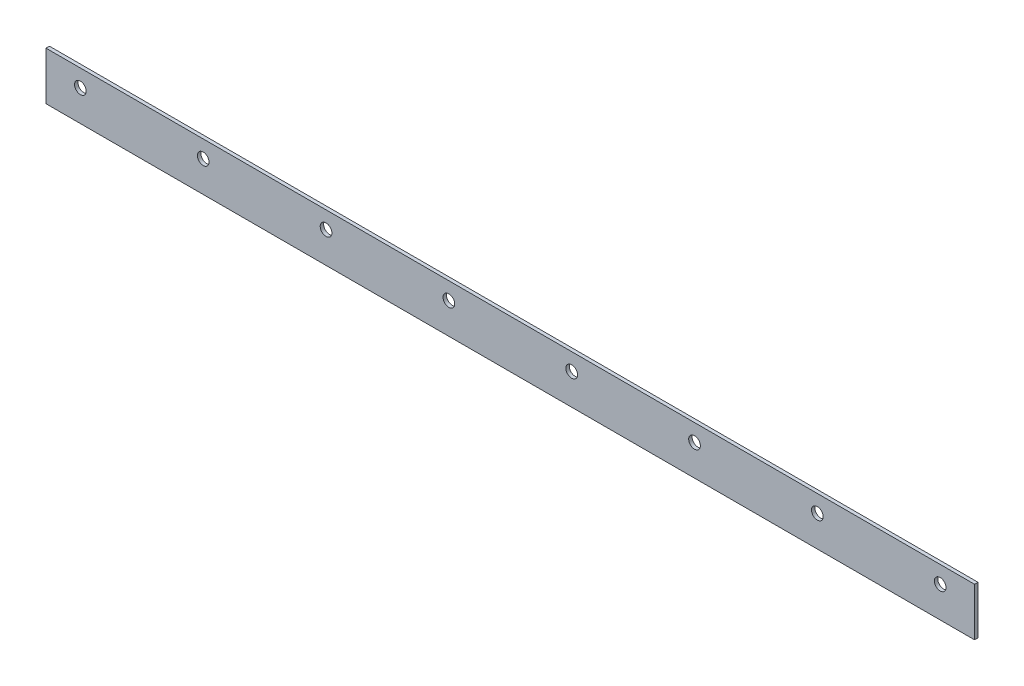
ISO-10303-21;
HEADER;
FILE_DESCRIPTION(('STEP AP214'),'2;1');
FILE_NAME('part.step','',(''),(''),'','','');
FILE_SCHEMA(('AUTOMOTIVE_DESIGN { 1 0 10303 214 1 1 1 1 }'));
ENDSEC;
DATA;
#1=APPLICATION_CONTEXT('core data for automotive mechanical design processes');
#2=APPLICATION_PROTOCOL_DEFINITION('international standard','automotive_design',2000,#1);
#3=PRODUCT_CONTEXT('',#1,'mechanical');
#4=PRODUCT('Part','Part','',(#3));
#5=PRODUCT_RELATED_PRODUCT_CATEGORY('part','',(#4));
#6=PRODUCT_DEFINITION_FORMATION('','',#4);
#7=PRODUCT_DEFINITION_CONTEXT('part definition',#1,'design');
#8=PRODUCT_DEFINITION('design','',#6,#7);
#9=PRODUCT_DEFINITION_SHAPE('','',#8);
#10=(LENGTH_UNIT() NAMED_UNIT(*) SI_UNIT(.MILLI.,.METRE.));
#11=(NAMED_UNIT(*) PLANE_ANGLE_UNIT() SI_UNIT($,.RADIAN.));
#12=(NAMED_UNIT(*) SI_UNIT($,.STERADIAN.) SOLID_ANGLE_UNIT());
#13=UNCERTAINTY_MEASURE_WITH_UNIT(LENGTH_MEASURE(1.E-05),#10,'distance_accuracy_value','');
#14=(GEOMETRIC_REPRESENTATION_CONTEXT(3) GLOBAL_UNCERTAINTY_ASSIGNED_CONTEXT((#13)) GLOBAL_UNIT_ASSIGNED_CONTEXT((#10,
#11,#12)) REPRESENTATION_CONTEXT('',''));
#15=CARTESIAN_POINT('',(0.,0.,0.));
#16=DIRECTION('',(0.,0.,1.));
#17=DIRECTION('',(1.,0.,0.));
#18=AXIS2_PLACEMENT_3D('',#15,#16,#17);
#19=CARTESIAN_POINT('',(-125.,1.99999999999995,1.));
#20=DIRECTION('',(0.,0.,1.));
#21=DIRECTION('',(1.,0.,0.));
#22=AXIS2_PLACEMENT_3D('',#19,#20,#21);
#23=CYLINDRICAL_SURFACE('',#22,1.69999999999999);
#24=CARTESIAN_POINT('',(-125.,1.99999999999995,0.));
#25=DIRECTION('',(0.,0.,1.));
#26=DIRECTION('',(1.,0.,0.));
#27=AXIS2_PLACEMENT_3D('',#24,#25,#26);
#28=CIRCLE('',#27,1.69999999999999);
#29=CARTESIAN_POINT('',(-123.3,1.99999999999995,0.));
#30=VERTEX_POINT('',#29);
#31=EDGE_CURVE('E43',#30,#30,#28,.T.);
#32=ORIENTED_EDGE('',*,*,#31,.F.);
#33=EDGE_LOOP('',(#32));
#34=FACE_BOUND('',#33,.T.);
#35=CARTESIAN_POINT('',(-125.,1.99999999999995,1.));
#36=DIRECTION('',(0.,0.,1.));
#37=DIRECTION('',(1.,0.,0.));
#38=AXIS2_PLACEMENT_3D('',#35,#36,#37);
#39=CIRCLE('',#38,1.69999999999999);
#40=CARTESIAN_POINT('',(-123.3,1.99999999999995,1.));
#41=VERTEX_POINT('',#40);
#42=EDGE_CURVE('E11',#41,#41,#39,.T.);
#43=ORIENTED_EDGE('',*,*,#42,.T.);
#44=EDGE_LOOP('',(#43));
#45=FACE_BOUND('',#44,.T.);
#46=ADVANCED_FACE('F35',(#34,#45),#23,.F.);
#47=CARTESIAN_POINT('',(-89.2857142857143,1.99999999999996,1.));
#48=DIRECTION('',(0.,0.,1.));
#49=DIRECTION('',(1.,0.,0.));
#50=AXIS2_PLACEMENT_3D('',#47,#48,#49);
#51=CYLINDRICAL_SURFACE('',#50,1.69999999999999);
#52=CARTESIAN_POINT('',(-89.2857142857143,1.99999999999996,0.));
#53=DIRECTION('',(0.,0.,1.));
#54=DIRECTION('',(1.,0.,0.));
#55=AXIS2_PLACEMENT_3D('',#52,#53,#54);
#56=CIRCLE('',#55,1.69999999999999);
#57=CARTESIAN_POINT('',(-87.5857142857143,1.99999999999996,0.));
#58=VERTEX_POINT('',#57);
#59=EDGE_CURVE('E137',#58,#58,#56,.T.);
#60=ORIENTED_EDGE('',*,*,#59,.F.);
#61=EDGE_LOOP('',(#60));
#62=FACE_BOUND('',#61,.T.);
#63=CARTESIAN_POINT('',(-89.2857142857143,1.99999999999996,1.));
#64=DIRECTION('',(0.,0.,1.));
#65=DIRECTION('',(1.,0.,0.));
#66=AXIS2_PLACEMENT_3D('',#63,#64,#65);
#67=CIRCLE('',#66,1.69999999999999);
#68=CARTESIAN_POINT('',(-87.5857142857143,1.99999999999996,1.));
#69=VERTEX_POINT('',#68);
#70=EDGE_CURVE('E140',#69,#69,#67,.T.);
#71=ORIENTED_EDGE('',*,*,#70,.T.);
#72=EDGE_LOOP('',(#71));
#73=FACE_BOUND('',#72,.T.);
#74=ADVANCED_FACE('F149',(#62,#73),#51,.F.);
#75=CARTESIAN_POINT('',(-53.5714285714286,1.99999999999996,1.));
#76=DIRECTION('',(0.,0.,1.));
#77=DIRECTION('',(1.,0.,0.));
#78=AXIS2_PLACEMENT_3D('',#75,#76,#77);
#79=CYLINDRICAL_SURFACE('',#78,1.69999999999999);
#80=CARTESIAN_POINT('',(-53.5714285714286,1.99999999999996,0.));
#81=DIRECTION('',(0.,0.,1.));
#82=DIRECTION('',(1.,0.,0.));
#83=AXIS2_PLACEMENT_3D('',#80,#81,#82);
#84=CIRCLE('',#83,1.69999999999999);
#85=CARTESIAN_POINT('',(-51.8714285714286,1.99999999999996,0.));
#86=VERTEX_POINT('',#85);
#87=EDGE_CURVE('E131',#86,#86,#84,.T.);
#88=ORIENTED_EDGE('',*,*,#87,.F.);
#89=EDGE_LOOP('',(#88));
#90=FACE_BOUND('',#89,.T.);
#91=CARTESIAN_POINT('',(-53.5714285714286,1.99999999999996,1.));
#92=DIRECTION('',(0.,0.,1.));
#93=DIRECTION('',(1.,0.,0.));
#94=AXIS2_PLACEMENT_3D('',#91,#92,#93);
#95=CIRCLE('',#94,1.69999999999999);
#96=CARTESIAN_POINT('',(-51.8714285714286,1.99999999999996,1.));
#97=VERTEX_POINT('',#96);
#98=EDGE_CURVE('E134',#97,#97,#95,.T.);
#99=ORIENTED_EDGE('',*,*,#98,.T.);
#100=EDGE_LOOP('',(#99));
#101=FACE_BOUND('',#100,.T.);
#102=ADVANCED_FACE('F188',(#90,#101),#79,.F.);
#103=CARTESIAN_POINT('',(-17.8571428571429,1.99999999999997,1.));
#104=DIRECTION('',(0.,0.,1.));
#105=DIRECTION('',(1.,0.,0.));
#106=AXIS2_PLACEMENT_3D('',#103,#104,#105);
#107=CYLINDRICAL_SURFACE('',#106,1.69999999999999);
#108=CARTESIAN_POINT('',(-17.8571428571429,1.99999999999997,0.));
#109=DIRECTION('',(0.,0.,1.));
#110=DIRECTION('',(1.,0.,0.));
#111=AXIS2_PLACEMENT_3D('',#108,#109,#110);
#112=CIRCLE('',#111,1.69999999999999);
#113=CARTESIAN_POINT('',(-16.1571428571429,1.99999999999997,0.));
#114=VERTEX_POINT('',#113);
#115=EDGE_CURVE('E125',#114,#114,#112,.T.);
#116=ORIENTED_EDGE('',*,*,#115,.F.);
#117=EDGE_LOOP('',(#116));
#118=FACE_BOUND('',#117,.T.);
#119=CARTESIAN_POINT('',(-17.8571428571429,1.99999999999997,1.));
#120=DIRECTION('',(0.,0.,1.));
#121=DIRECTION('',(1.,0.,0.));
#122=AXIS2_PLACEMENT_3D('',#119,#120,#121);
#123=CIRCLE('',#122,1.69999999999999);
#124=CARTESIAN_POINT('',(-16.1571428571429,1.99999999999997,1.));
#125=VERTEX_POINT('',#124);
#126=EDGE_CURVE('E128',#125,#125,#123,.T.);
#127=ORIENTED_EDGE('',*,*,#126,.T.);
#128=EDGE_LOOP('',(#127));
#129=FACE_BOUND('',#128,.T.);
#130=ADVANCED_FACE('F184',(#118,#129),#107,.F.);
#131=CARTESIAN_POINT('',(17.8571428571429,1.99999999999997,1.));
#132=DIRECTION('',(0.,0.,1.));
#133=DIRECTION('',(1.,0.,0.));
#134=AXIS2_PLACEMENT_3D('',#131,#132,#133);
#135=CYLINDRICAL_SURFACE('',#134,1.69999999999999);
#136=CARTESIAN_POINT('',(17.8571428571429,1.99999999999997,0.));
#137=DIRECTION('',(0.,0.,1.));
#138=DIRECTION('',(1.,0.,0.));
#139=AXIS2_PLACEMENT_3D('',#136,#137,#138);
#140=CIRCLE('',#139,1.69999999999999);
#141=CARTESIAN_POINT('',(19.5571428571428,1.99999999999997,0.));
#142=VERTEX_POINT('',#141);
#143=EDGE_CURVE('E119',#142,#142,#140,.T.);
#144=ORIENTED_EDGE('',*,*,#143,.F.);
#145=EDGE_LOOP('',(#144));
#146=FACE_BOUND('',#145,.T.);
#147=CARTESIAN_POINT('',(17.8571428571429,1.99999999999997,1.));
#148=DIRECTION('',(0.,0.,1.));
#149=DIRECTION('',(1.,0.,0.));
#150=AXIS2_PLACEMENT_3D('',#147,#148,#149);
#151=CIRCLE('',#150,1.69999999999999);
#152=CARTESIAN_POINT('',(19.5571428571428,1.99999999999997,1.));
#153=VERTEX_POINT('',#152);
#154=EDGE_CURVE('E122',#153,#153,#151,.T.);
#155=ORIENTED_EDGE('',*,*,#154,.T.);
#156=EDGE_LOOP('',(#155));
#157=FACE_BOUND('',#156,.T.);
#158=ADVANCED_FACE('F180',(#146,#157),#135,.F.);
#159=CARTESIAN_POINT('',(53.5714285714286,1.99999999999997,1.));
#160=DIRECTION('',(0.,0.,1.));
#161=DIRECTION('',(1.,0.,0.));
#162=AXIS2_PLACEMENT_3D('',#159,#160,#161);
#163=CYLINDRICAL_SURFACE('',#162,1.69999999999999);
#164=CARTESIAN_POINT('',(53.5714285714286,1.99999999999997,0.));
#165=DIRECTION('',(0.,0.,1.));
#166=DIRECTION('',(1.,0.,0.));
#167=AXIS2_PLACEMENT_3D('',#164,#165,#166);
#168=CIRCLE('',#167,1.69999999999999);
#169=CARTESIAN_POINT('',(55.2714285714286,1.99999999999997,0.));
#170=VERTEX_POINT('',#169);
#171=EDGE_CURVE('E113',#170,#170,#168,.T.);
#172=ORIENTED_EDGE('',*,*,#171,.F.);
#173=EDGE_LOOP('',(#172));
#174=FACE_BOUND('',#173,.T.);
#175=CARTESIAN_POINT('',(53.5714285714286,1.99999999999997,1.));
#176=DIRECTION('',(0.,0.,1.));
#177=DIRECTION('',(1.,0.,0.));
#178=AXIS2_PLACEMENT_3D('',#175,#176,#177);
#179=CIRCLE('',#178,1.69999999999999);
#180=CARTESIAN_POINT('',(55.2714285714286,1.99999999999997,1.));
#181=VERTEX_POINT('',#180);
#182=EDGE_CURVE('E116',#181,#181,#179,.T.);
#183=ORIENTED_EDGE('',*,*,#182,.T.);
#184=EDGE_LOOP('',(#183));
#185=FACE_BOUND('',#184,.T.);
#186=ADVANCED_FACE('F176',(#174,#185),#163,.F.);
#187=CARTESIAN_POINT('',(-135.,-7.00000000000002,1.));
#188=DIRECTION('',(1.,0.,0.));
#189=DIRECTION('',(0.,0.,-1.));
#190=AXIS2_PLACEMENT_3D('',#187,#188,#189);
#191=PLANE('',#190);
#192=DIRECTION('',(0.,-1.,0.));
#193=VECTOR('',#192,1.);
#194=CARTESIAN_POINT('',(-135.,-7.00000000000002,0.));
#195=LINE('',#194,#193);
#196=CARTESIAN_POINT('',(-135.,6.99999999999998,0.));
#197=VERTEX_POINT('',#196);
#198=CARTESIAN_POINT('',(-135.,-7.00000000000002,0.));
#199=VERTEX_POINT('',#198);
#200=EDGE_CURVE('E103',#197,#199,#195,.T.);
#201=ORIENTED_EDGE('',*,*,#200,.T.);
#202=DIRECTION('',(0.,0.,-1.));
#203=VECTOR('',#202,1.);
#204=CARTESIAN_POINT('',(-135.,-7.00000000000002,1.));
#205=LINE('',#204,#203);
#206=CARTESIAN_POINT('',(-135.,-7.00000000000002,1.));
#207=VERTEX_POINT('',#206);
#208=EDGE_CURVE('E94',#207,#199,#205,.T.);
#209=ORIENTED_EDGE('',*,*,#208,.F.);
#210=DIRECTION('',(0.,-1.,0.));
#211=VECTOR('',#210,1.);
#212=CARTESIAN_POINT('',(-135.,-7.00000000000002,1.));
#213=LINE('',#212,#211);
#214=CARTESIAN_POINT('',(-135.,6.99999999999998,1.));
#215=VERTEX_POINT('',#214);
#216=EDGE_CURVE('E88',#215,#207,#213,.T.);
#217=ORIENTED_EDGE('',*,*,#216,.F.);
#218=DIRECTION('',(0.,0.,-1.));
#219=VECTOR('',#218,1.);
#220=CARTESIAN_POINT('',(-135.,6.99999999999998,1.));
#221=LINE('',#220,#219);
#222=EDGE_CURVE('E99',#215,#197,#221,.T.);
#223=ORIENTED_EDGE('',*,*,#222,.T.);
#224=EDGE_LOOP('',(#201,#209,#217,#223));
#225=FACE_BOUND('',#224,.T.);
#226=ADVANCED_FACE('F173',(#225),#191,.F.);
#227=CARTESIAN_POINT('',(135.,-6.99999999999998,1.));
#228=DIRECTION('',(0.,1.,0.));
#229=DIRECTION('',(-1.,0.,0.));
#230=AXIS2_PLACEMENT_3D('',#227,#228,#229);
#231=PLANE('',#230);
#232=DIRECTION('',(1.,0.,0.));
#233=VECTOR('',#232,1.);
#234=CARTESIAN_POINT('',(135.,-6.99999999999998,0.));
#235=LINE('',#234,#233);
#236=CARTESIAN_POINT('',(135.,-6.99999999999998,0.));
#237=VERTEX_POINT('',#236);
#238=EDGE_CURVE('E93',#199,#237,#235,.T.);
#239=ORIENTED_EDGE('',*,*,#238,.T.);
#240=DIRECTION('',(0.,0.,-1.));
#241=VECTOR('',#240,1.);
#242=CARTESIAN_POINT('',(135.,-6.99999999999998,1.));
#243=LINE('',#242,#241);
#244=CARTESIAN_POINT('',(135.,-6.99999999999998,1.));
#245=VERTEX_POINT('',#244);
#246=EDGE_CURVE('E91',#245,#237,#243,.T.);
#247=ORIENTED_EDGE('',*,*,#246,.F.);
#248=DIRECTION('',(1.,0.,0.));
#249=VECTOR('',#248,1.);
#250=CARTESIAN_POINT('',(135.,-6.99999999999998,1.));
#251=LINE('',#250,#249);
#252=EDGE_CURVE('E82',#207,#245,#251,.T.);
#253=ORIENTED_EDGE('',*,*,#252,.F.);
#254=ORIENTED_EDGE('',*,*,#208,.T.);
#255=EDGE_LOOP('',(#239,#247,#253,#254));
#256=FACE_BOUND('',#255,.T.);
#257=ADVANCED_FACE('F92',(#256),#231,.F.);
#258=CARTESIAN_POINT('',(135.,-6.99999999999998,1.));
#259=DIRECTION('',(-1.,0.,0.));
#260=DIRECTION('',(0.,0.,1.));
#261=AXIS2_PLACEMENT_3D('',#258,#259,#260);
#262=PLANE('',#261);
#263=DIRECTION('',(0.,1.,0.));
#264=VECTOR('',#263,1.);
#265=CARTESIAN_POINT('',(135.,-6.99999999999998,0.));
#266=LINE('',#265,#264);
#267=CARTESIAN_POINT('',(135.,7.00000000000002,0.));
#268=VERTEX_POINT('',#267);
#269=EDGE_CURVE('E68',#237,#268,#266,.T.);
#270=ORIENTED_EDGE('',*,*,#269,.T.);
#271=DIRECTION('',(0.,0.,-1.));
#272=VECTOR('',#271,1.);
#273=CARTESIAN_POINT('',(135.,7.00000000000002,1.));
#274=LINE('',#273,#272);
#275=CARTESIAN_POINT('',(135.,7.00000000000002,1.));
#276=VERTEX_POINT('',#275);
#277=EDGE_CURVE('E95',#276,#268,#274,.T.);
#278=ORIENTED_EDGE('',*,*,#277,.F.);
#279=DIRECTION('',(0.,1.,0.));
#280=VECTOR('',#279,1.);
#281=CARTESIAN_POINT('',(135.,-6.99999999999998,1.));
#282=LINE('',#281,#280);
#283=EDGE_CURVE('E86',#245,#276,#282,.T.);
#284=ORIENTED_EDGE('',*,*,#283,.F.);
#285=ORIENTED_EDGE('',*,*,#246,.T.);
#286=EDGE_LOOP('',(#270,#278,#284,#285));
#287=FACE_BOUND('',#286,.T.);
#288=ADVANCED_FACE('F97',(#287),#262,.F.);
#289=CARTESIAN_POINT('',(135.,7.00000000000002,1.));
#290=DIRECTION('',(0.,-1.,0.));
#291=DIRECTION('',(1.,0.,0.));
#292=AXIS2_PLACEMENT_3D('',#289,#290,#291);
#293=PLANE('',#292);
#294=DIRECTION('',(-1.,0.,0.));
#295=VECTOR('',#294,1.);
#296=CARTESIAN_POINT('',(135.,7.00000000000002,0.));
#297=LINE('',#296,#295);
#298=EDGE_CURVE('E74',#268,#197,#297,.T.);
#299=ORIENTED_EDGE('',*,*,#298,.T.);
#300=ORIENTED_EDGE('',*,*,#222,.F.);
#301=DIRECTION('',(-1.,0.,0.));
#302=VECTOR('',#301,1.);
#303=CARTESIAN_POINT('',(135.,7.00000000000002,1.));
#304=LINE('',#303,#302);
#305=EDGE_CURVE('E51',#276,#215,#304,.T.);
#306=ORIENTED_EDGE('',*,*,#305,.F.);
#307=ORIENTED_EDGE('',*,*,#277,.T.);
#308=EDGE_LOOP('',(#299,#300,#306,#307));
#309=FACE_BOUND('',#308,.T.);
#310=ADVANCED_FACE('F153',(#309),#293,.F.);
#311=CARTESIAN_POINT('',(0.,0.,1.));
#312=DIRECTION('',(0.,0.,1.));
#313=DIRECTION('',(1.,0.,0.));
#314=AXIS2_PLACEMENT_3D('',#311,#312,#313);
#315=PLANE('',#314);
#316=CARTESIAN_POINT('',(89.2857142857143,1.99999999999998,1.));
#317=DIRECTION('',(0.,0.,1.));
#318=DIRECTION('',(1.,0.,0.));
#319=AXIS2_PLACEMENT_3D('',#316,#317,#318);
#320=CIRCLE('',#319,1.69999999999999);
#321=CARTESIAN_POINT('',(90.9857142857143,1.99999999999998,1.));
#322=VERTEX_POINT('',#321);
#323=EDGE_CURVE('E285',#322,#322,#320,.T.);
#324=ORIENTED_EDGE('',*,*,#323,.F.);
#325=EDGE_LOOP('',(#324));
#326=FACE_BOUND('',#325,.T.);
#327=CARTESIAN_POINT('',(125.,1.99999999999998,1.));
#328=DIRECTION('',(0.,0.,1.));
#329=DIRECTION('',(1.,0.,0.));
#330=AXIS2_PLACEMENT_3D('',#327,#328,#329);
#331=CIRCLE('',#330,1.69999999999999);
#332=CARTESIAN_POINT('',(126.7,1.99999999999998,1.));
#333=VERTEX_POINT('',#332);
#334=EDGE_CURVE('E286',#333,#333,#331,.T.);
#335=ORIENTED_EDGE('',*,*,#334,.F.);
#336=EDGE_LOOP('',(#335));
#337=FACE_BOUND('',#336,.T.);
#338=ORIENTED_EDGE('',*,*,#216,.T.);
#339=ORIENTED_EDGE('',*,*,#252,.T.);
#340=ORIENTED_EDGE('',*,*,#283,.T.);
#341=ORIENTED_EDGE('',*,*,#305,.T.);
#342=EDGE_LOOP('',(#338,#339,#340,#341));
#343=FACE_BOUND('',#342,.T.);
#344=ORIENTED_EDGE('',*,*,#182,.F.);
#345=EDGE_LOOP('',(#344));
#346=FACE_BOUND('',#345,.T.);
#347=ORIENTED_EDGE('',*,*,#154,.F.);
#348=EDGE_LOOP('',(#347));
#349=FACE_BOUND('',#348,.T.);
#350=ORIENTED_EDGE('',*,*,#126,.F.);
#351=EDGE_LOOP('',(#350));
#352=FACE_BOUND('',#351,.T.);
#353=ORIENTED_EDGE('',*,*,#98,.F.);
#354=EDGE_LOOP('',(#353));
#355=FACE_BOUND('',#354,.T.);
#356=ORIENTED_EDGE('',*,*,#70,.F.);
#357=EDGE_LOOP('',(#356));
#358=FACE_BOUND('',#357,.T.);
#359=ORIENTED_EDGE('',*,*,#42,.F.);
#360=EDGE_LOOP('',(#359));
#361=FACE_BOUND('',#360,.T.);
#362=ADVANCED_FACE('F83',(#326,#337,#343,#346,#349,#352,#355,#358,#361),#315,.T.);
#363=CARTESIAN_POINT('',(0.,0.,0.));
#364=DIRECTION('',(0.,0.,1.));
#365=DIRECTION('',(1.,0.,0.));
#366=AXIS2_PLACEMENT_3D('',#363,#364,#365);
#367=PLANE('',#366);
#368=CARTESIAN_POINT('',(89.2857142857143,1.99999999999998,0.));
#369=DIRECTION('',(0.,0.,1.));
#370=DIRECTION('',(1.,0.,0.));
#371=AXIS2_PLACEMENT_3D('',#368,#369,#370);
#372=CIRCLE('',#371,1.69999999999999);
#373=CARTESIAN_POINT('',(90.9857142857143,1.99999999999998,0.));
#374=VERTEX_POINT('',#373);
#375=EDGE_CURVE('E283',#374,#374,#372,.T.);
#376=ORIENTED_EDGE('',*,*,#375,.T.);
#377=EDGE_LOOP('',(#376));
#378=FACE_BOUND('',#377,.T.);
#379=CARTESIAN_POINT('',(125.,1.99999999999998,0.));
#380=DIRECTION('',(0.,0.,1.));
#381=DIRECTION('',(1.,0.,0.));
#382=AXIS2_PLACEMENT_3D('',#379,#380,#381);
#383=CIRCLE('',#382,1.69999999999999);
#384=CARTESIAN_POINT('',(126.7,1.99999999999998,0.));
#385=VERTEX_POINT('',#384);
#386=EDGE_CURVE('E106',#385,#385,#383,.T.);
#387=ORIENTED_EDGE('',*,*,#386,.T.);
#388=EDGE_LOOP('',(#387));
#389=FACE_BOUND('',#388,.T.);
#390=ORIENTED_EDGE('',*,*,#200,.F.);
#391=ORIENTED_EDGE('',*,*,#298,.F.);
#392=ORIENTED_EDGE('',*,*,#269,.F.);
#393=ORIENTED_EDGE('',*,*,#238,.F.);
#394=EDGE_LOOP('',(#390,#391,#392,#393));
#395=FACE_BOUND('',#394,.T.);
#396=ORIENTED_EDGE('',*,*,#171,.T.);
#397=EDGE_LOOP('',(#396));
#398=FACE_BOUND('',#397,.T.);
#399=ORIENTED_EDGE('',*,*,#143,.T.);
#400=EDGE_LOOP('',(#399));
#401=FACE_BOUND('',#400,.T.);
#402=ORIENTED_EDGE('',*,*,#115,.T.);
#403=EDGE_LOOP('',(#402));
#404=FACE_BOUND('',#403,.T.);
#405=ORIENTED_EDGE('',*,*,#87,.T.);
#406=EDGE_LOOP('',(#405));
#407=FACE_BOUND('',#406,.T.);
#408=ORIENTED_EDGE('',*,*,#59,.T.);
#409=EDGE_LOOP('',(#408));
#410=FACE_BOUND('',#409,.T.);
#411=ORIENTED_EDGE('',*,*,#31,.T.);
#412=EDGE_LOOP('',(#411));
#413=FACE_BOUND('',#412,.T.);
#414=ADVANCED_FACE('F145',(#378,#389,#395,#398,#401,#404,#407,#410,#413),#367,.F.);
#415=CARTESIAN_POINT('',(125.,1.99999999999998,1.));
#416=DIRECTION('',(0.,0.,1.));
#417=DIRECTION('',(1.,0.,0.));
#418=AXIS2_PLACEMENT_3D('',#415,#416,#417);
#419=CYLINDRICAL_SURFACE('',#418,1.69999999999999);
#420=ORIENTED_EDGE('',*,*,#386,.F.);
#421=EDGE_LOOP('',(#420));
#422=FACE_BOUND('',#421,.T.);
#423=ORIENTED_EDGE('',*,*,#334,.T.);
#424=EDGE_LOOP('',(#423));
#425=FACE_BOUND('',#424,.T.);
#426=ADVANCED_FACE('F160',(#422,#425),#419,.F.);
#427=CARTESIAN_POINT('',(89.2857142857143,1.99999999999998,1.));
#428=DIRECTION('',(0.,0.,1.));
#429=DIRECTION('',(1.,0.,0.));
#430=AXIS2_PLACEMENT_3D('',#427,#428,#429);
#431=CYLINDRICAL_SURFACE('',#430,1.69999999999999);
#432=ORIENTED_EDGE('',*,*,#375,.F.);
#433=EDGE_LOOP('',(#432));
#434=FACE_BOUND('',#433,.T.);
#435=ORIENTED_EDGE('',*,*,#323,.T.);
#436=EDGE_LOOP('',(#435));
#437=FACE_BOUND('',#436,.T.);
#438=ADVANCED_FACE('F244',(#434,#437),#431,.F.);
#439=CLOSED_SHELL('',(#46,#74,#102,#130,#158,#186,#226,#257,#288,#310,#362,#414,#426,#438));
#440=MANIFOLD_SOLID_BREP('B2',#439);
#441=ADVANCED_BREP_SHAPE_REPRESENTATION('',(#18,#440),#14);
#442=SHAPE_DEFINITION_REPRESENTATION(#9,#441);
ENDSEC;
END-ISO-10303-21;
